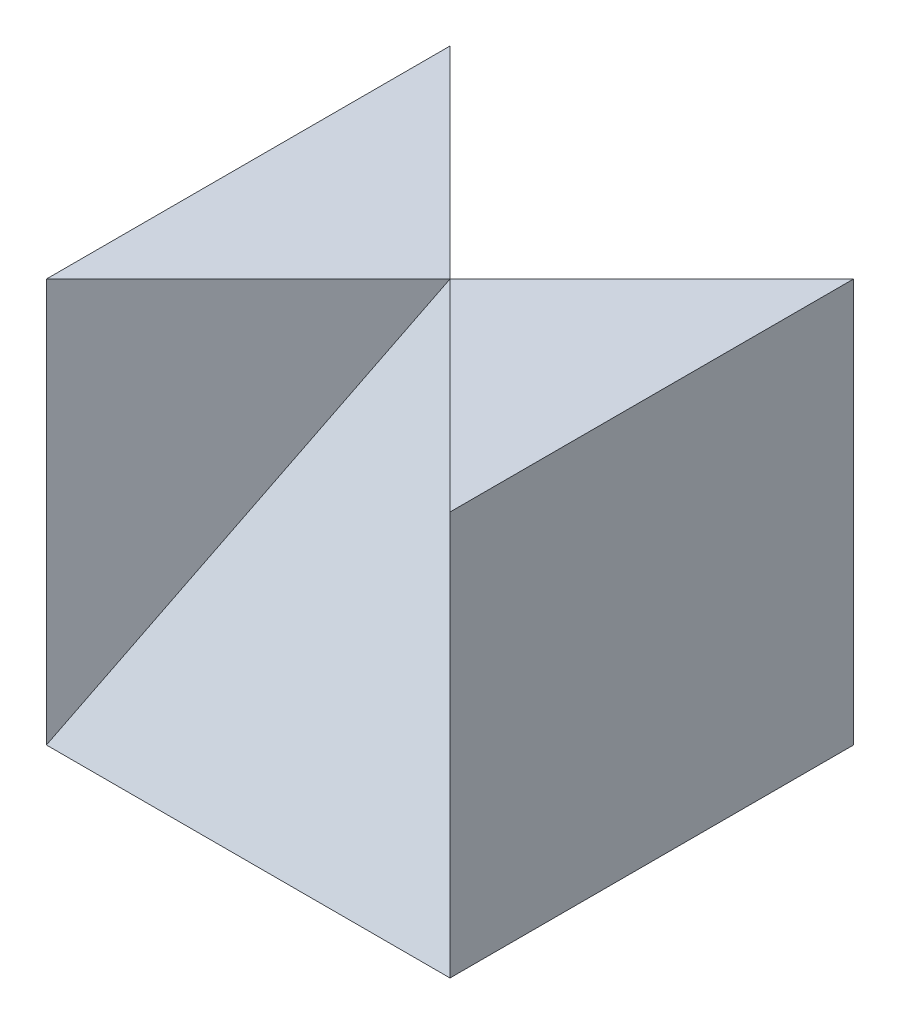
ISO-10303-21;
HEADER;
FILE_DESCRIPTION(('STEP AP214'),'2;1');
FILE_NAME('part.step','',(''),(''),'','','');
FILE_SCHEMA(('AUTOMOTIVE_DESIGN { 1 0 10303 214 1 1 1 1 }'));
ENDSEC;
DATA;
#1=APPLICATION_CONTEXT('core data for automotive mechanical design processes');
#2=APPLICATION_PROTOCOL_DEFINITION('international standard','automotive_design',2000,#1);
#3=PRODUCT_CONTEXT('',#1,'mechanical');
#4=PRODUCT('Part','Part','',(#3));
#5=PRODUCT_RELATED_PRODUCT_CATEGORY('part','',(#4));
#6=PRODUCT_DEFINITION_FORMATION('','',#4);
#7=PRODUCT_DEFINITION_CONTEXT('part definition',#1,'design');
#8=PRODUCT_DEFINITION('design','',#6,#7);
#9=PRODUCT_DEFINITION_SHAPE('','',#8);
#10=(LENGTH_UNIT() NAMED_UNIT(*) SI_UNIT(.MILLI.,.METRE.));
#11=(NAMED_UNIT(*) PLANE_ANGLE_UNIT() SI_UNIT($,.RADIAN.));
#12=(NAMED_UNIT(*) SI_UNIT($,.STERADIAN.) SOLID_ANGLE_UNIT());
#13=UNCERTAINTY_MEASURE_WITH_UNIT(LENGTH_MEASURE(1.E-05),#10,'distance_accuracy_value','');
#14=(GEOMETRIC_REPRESENTATION_CONTEXT(3) GLOBAL_UNCERTAINTY_ASSIGNED_CONTEXT((#13)) GLOBAL_UNIT_ASSIGNED_CONTEXT((#10,
#11,#12)) REPRESENTATION_CONTEXT('',''));
#15=CARTESIAN_POINT('',(0.,0.,0.));
#16=DIRECTION('',(0.,0.,1.));
#17=DIRECTION('',(1.,0.,0.));
#18=AXIS2_PLACEMENT_3D('',#15,#16,#17);
#19=CARTESIAN_POINT('',(0.,4.,0.));
#20=DIRECTION('',(0.,-1.,0.));
#21=DIRECTION('',(0.,0.,-1.));
#22=AXIS2_PLACEMENT_3D('',#19,#20,#21);
#23=PLANE('',#22);
#24=DIRECTION('',(0.707106781186548,0.,-0.707106781186548));
#25=VECTOR('',#24,1.);
#26=CARTESIAN_POINT('',(0.,4.,0.));
#27=LINE('',#26,#25);
#28=CARTESIAN_POINT('',(0.,4.,0.));
#29=VERTEX_POINT('',#28);
#30=CARTESIAN_POINT('',(2.,4.,-2.));
#31=VERTEX_POINT('',#30);
#32=EDGE_CURVE('E91',#29,#31,#27,.T.);
#33=ORIENTED_EDGE('',*,*,#32,.F.);
#34=DIRECTION('',(-0.707106781186548,0.,-0.707106781186548));
#35=VECTOR('',#34,1.);
#36=CARTESIAN_POINT('',(0.,4.,0.));
#37=LINE('',#36,#35);
#38=CARTESIAN_POINT('',(2.,4.,2.));
#39=VERTEX_POINT('',#38);
#40=EDGE_CURVE('E106',#39,#29,#37,.T.);
#41=ORIENTED_EDGE('',*,*,#40,.F.);
#42=DIRECTION('',(0.,0.,-1.));
#43=VECTOR('',#42,1.);
#44=CARTESIAN_POINT('',(2.,4.,2.));
#45=LINE('',#44,#43);
#46=EDGE_CURVE('E108',#39,#31,#45,.T.);
#47=ORIENTED_EDGE('',*,*,#46,.T.);
#48=EDGE_LOOP('',(#33,#41,#47));
#49=FACE_BOUND('',#48,.T.);
#50=ADVANCED_FACE('F35',(#49),#23,.F.);
#51=DIRECTION('',(-0.707106781186548,0.,0.707106781186548));
#52=VECTOR('',#51,1.);
#53=CARTESIAN_POINT('',(0.,4.,0.));
#54=LINE('',#53,#52);
#55=CARTESIAN_POINT('',(-2.,4.,2.));
#56=VERTEX_POINT('',#55);
#57=EDGE_CURVE('E117',#29,#56,#54,.T.);
#58=ORIENTED_EDGE('',*,*,#57,.F.);
#59=DIRECTION('',(-0.707106781186548,0.,-0.707106781186548));
#60=VECTOR('',#59,1.);
#61=CARTESIAN_POINT('',(0.,4.,0.));
#62=LINE('',#61,#60);
#63=CARTESIAN_POINT('',(-2.,4.,-2.));
#64=VERTEX_POINT('',#63);
#65=EDGE_CURVE('E80',#29,#64,#62,.T.);
#66=ORIENTED_EDGE('',*,*,#65,.T.);
#67=DIRECTION('',(0.,0.,1.));
#68=VECTOR('',#67,1.);
#69=CARTESIAN_POINT('',(-2.,4.,2.));
#70=LINE('',#69,#68);
#71=EDGE_CURVE('E129',#64,#56,#70,.T.);
#72=ORIENTED_EDGE('',*,*,#71,.T.);
#73=EDGE_LOOP('',(#58,#66,#72));
#74=FACE_BOUND('',#73,.T.);
#75=ADVANCED_FACE('F128',(#74),#23,.F.);
#76=CARTESIAN_POINT('',(2.,4.,2.));
#77=DIRECTION('',(-1.,0.,0.));
#78=DIRECTION('',(0.,0.,1.));
#79=AXIS2_PLACEMENT_3D('',#76,#77,#78);
#80=PLANE('',#79);
#81=DIRECTION('',(0.,0.,-1.));
#82=VECTOR('',#81,1.);
#83=CARTESIAN_POINT('',(2.,0.,2.));
#84=LINE('',#83,#82);
#85=CARTESIAN_POINT('',(2.,0.,2.));
#86=VERTEX_POINT('',#85);
#87=CARTESIAN_POINT('',(2.,0.,-2.));
#88=VERTEX_POINT('',#87);
#89=EDGE_CURVE('E116',#86,#88,#84,.T.);
#90=ORIENTED_EDGE('',*,*,#89,.T.);
#91=DIRECTION('',(0.,-1.,0.));
#92=VECTOR('',#91,1.);
#93=CARTESIAN_POINT('',(2.,4.,-2.));
#94=LINE('',#93,#92);
#95=EDGE_CURVE('E12',#31,#88,#94,.T.);
#96=ORIENTED_EDGE('',*,*,#95,.F.);
#97=ORIENTED_EDGE('',*,*,#46,.F.);
#98=DIRECTION('',(0.,-1.,0.));
#99=VECTOR('',#98,1.);
#100=CARTESIAN_POINT('',(2.,4.,2.));
#101=LINE('',#100,#99);
#102=EDGE_CURVE('E115',#39,#86,#101,.T.);
#103=ORIENTED_EDGE('',*,*,#102,.T.);
#104=EDGE_LOOP('',(#90,#96,#97,#103));
#105=FACE_BOUND('',#104,.T.);
#106=ADVANCED_FACE('F37',(#105),#80,.F.);
#107=CARTESIAN_POINT('',(-2.,4.,2.));
#108=DIRECTION('',(1.,0.,0.));
#109=DIRECTION('',(0.,0.,-1.));
#110=AXIS2_PLACEMENT_3D('',#107,#108,#109);
#111=PLANE('',#110);
#112=DIRECTION('',(0.,0.,1.));
#113=VECTOR('',#112,1.);
#114=CARTESIAN_POINT('',(-2.,0.,2.));
#115=LINE('',#114,#113);
#116=CARTESIAN_POINT('',(-2.,0.,-2.));
#117=VERTEX_POINT('',#116);
#118=CARTESIAN_POINT('',(-2.,0.,2.));
#119=VERTEX_POINT('',#118);
#120=EDGE_CURVE('E140',#117,#119,#115,.T.);
#121=ORIENTED_EDGE('',*,*,#120,.T.);
#122=DIRECTION('',(0.,-1.,0.));
#123=VECTOR('',#122,1.);
#124=CARTESIAN_POINT('',(-2.,4.,2.));
#125=LINE('',#124,#123);
#126=EDGE_CURVE('E52',#56,#119,#125,.T.);
#127=ORIENTED_EDGE('',*,*,#126,.F.);
#128=ORIENTED_EDGE('',*,*,#71,.F.);
#129=DIRECTION('',(0.,-1.,0.));
#130=VECTOR('',#129,1.);
#131=CARTESIAN_POINT('',(-2.,4.,-2.));
#132=LINE('',#131,#130);
#133=EDGE_CURVE('E44',#64,#117,#132,.T.);
#134=ORIENTED_EDGE('',*,*,#133,.T.);
#135=EDGE_LOOP('',(#121,#127,#128,#134));
#136=FACE_BOUND('',#135,.T.);
#137=ADVANCED_FACE('F163',(#136),#111,.F.);
#138=CARTESIAN_POINT('',(0.,0.,0.));
#139=DIRECTION('',(0.,-1.,0.));
#140=DIRECTION('',(0.,0.,-1.));
#141=AXIS2_PLACEMENT_3D('',#138,#139,#140);
#142=PLANE('',#141);
#143=ORIENTED_EDGE('',*,*,#89,.F.);
#144=DIRECTION('',(1.,0.,0.));
#145=VECTOR('',#144,1.);
#146=CARTESIAN_POINT('',(-2.,0.,2.));
#147=LINE('',#146,#145);
#148=EDGE_CURVE('E124',#119,#86,#147,.T.);
#149=ORIENTED_EDGE('',*,*,#148,.F.);
#150=ORIENTED_EDGE('',*,*,#120,.F.);
#151=DIRECTION('',(-1.,0.,0.));
#152=VECTOR('',#151,1.);
#153=CARTESIAN_POINT('',(-2.,0.,-2.));
#154=LINE('',#153,#152);
#155=EDGE_CURVE('E101',#88,#117,#154,.T.);
#156=ORIENTED_EDGE('',*,*,#155,.F.);
#157=EDGE_LOOP('',(#143,#149,#150,#156));
#158=FACE_BOUND('',#157,.T.);
#159=ADVANCED_FACE('F166',(#158),#142,.T.);
#160=CARTESIAN_POINT('',(0.,4.,0.));
#161=DIRECTION('',(-0.707106781186548,0.,0.707106781186548));
#162=DIRECTION('',(0.707106781186548,0.,0.707106781186548));
#163=AXIS2_PLACEMENT_3D('',#160,#161,#162);
#164=PLANE('',#163);
#165=ORIENTED_EDGE('',*,*,#40,.T.);
#166=DIRECTION('',(0.408248290463863,-0.816496580927726,0.408248290463863));
#167=VECTOR('',#166,1.);
#168=CARTESIAN_POINT('',(0.,4.,0.));
#169=LINE('',#168,#167);
#170=EDGE_CURVE('E90',#29,#86,#169,.T.);
#171=ORIENTED_EDGE('',*,*,#170,.T.);
#172=ORIENTED_EDGE('',*,*,#102,.F.);
#173=EDGE_LOOP('',(#165,#171,#172));
#174=FACE_BOUND('',#173,.T.);
#175=ADVANCED_FACE('F113',(#174),#164,.T.);
#176=CARTESIAN_POINT('',(-2.,0.,2.));
#177=DIRECTION('',(0.707106781186548,0.,0.707106781186548));
#178=DIRECTION('',(0.707106781186548,0.,-0.707106781186548));
#179=AXIS2_PLACEMENT_3D('',#176,#177,#178);
#180=PLANE('',#179);
#181=ORIENTED_EDGE('',*,*,#57,.T.);
#182=ORIENTED_EDGE('',*,*,#126,.T.);
#183=DIRECTION('',(0.408248290463863,0.816496580927726,-0.408248290463863));
#184=VECTOR('',#183,1.);
#185=CARTESIAN_POINT('',(-2.,0.,2.));
#186=LINE('',#185,#184);
#187=EDGE_CURVE('E121',#119,#29,#186,.T.);
#188=ORIENTED_EDGE('',*,*,#187,.T.);
#189=EDGE_LOOP('',(#181,#182,#188));
#190=FACE_BOUND('',#189,.T.);
#191=ADVANCED_FACE('F126',(#190),#180,.T.);
#192=CARTESIAN_POINT('',(0.,0.8,1.6));
#193=DIRECTION('',(0.,0.447213595499958,0.894427190999916));
#194=DIRECTION('',(0.,-0.894427190999916,0.447213595499958));
#195=AXIS2_PLACEMENT_3D('',#192,#193,#194);
#196=PLANE('',#195);
#197=ORIENTED_EDGE('',*,*,#148,.T.);
#198=ORIENTED_EDGE('',*,*,#170,.F.);
#199=ORIENTED_EDGE('',*,*,#187,.F.);
#200=EDGE_LOOP('',(#197,#198,#199));
#201=FACE_BOUND('',#200,.T.);
#202=ADVANCED_FACE('F120',(#201),#196,.T.);
#203=CARTESIAN_POINT('',(-2.,0.,-2.));
#204=DIRECTION('',(-0.707106781186548,0.,0.707106781186548));
#205=DIRECTION('',(0.707106781186548,0.,0.707106781186548));
#206=AXIS2_PLACEMENT_3D('',#203,#204,#205);
#207=PLANE('',#206);
#208=DIRECTION('',(0.408248290463863,0.816496580927726,0.408248290463863));
#209=VECTOR('',#208,1.);
#210=CARTESIAN_POINT('',(-2.,0.,-2.));
#211=LINE('',#210,#209);
#212=EDGE_CURVE('E83',#117,#29,#211,.T.);
#213=ORIENTED_EDGE('',*,*,#212,.F.);
#214=ORIENTED_EDGE('',*,*,#133,.F.);
#215=ORIENTED_EDGE('',*,*,#65,.F.);
#216=EDGE_LOOP('',(#213,#214,#215));
#217=FACE_BOUND('',#216,.T.);
#218=ADVANCED_FACE('F81',(#217),#207,.F.);
#219=CARTESIAN_POINT('',(2.,0.,-2.));
#220=DIRECTION('',(-0.707106781186548,0.,-0.707106781186548));
#221=DIRECTION('',(-0.707106781186548,0.,0.707106781186548));
#222=AXIS2_PLACEMENT_3D('',#219,#220,#221);
#223=PLANE('',#222);
#224=ORIENTED_EDGE('',*,*,#32,.T.);
#225=ORIENTED_EDGE('',*,*,#95,.T.);
#226=DIRECTION('',(-0.408248290463863,0.816496580927726,0.408248290463863));
#227=VECTOR('',#226,1.);
#228=CARTESIAN_POINT('',(2.,0.,-2.));
#229=LINE('',#228,#227);
#230=EDGE_CURVE('E93',#88,#29,#229,.T.);
#231=ORIENTED_EDGE('',*,*,#230,.T.);
#232=EDGE_LOOP('',(#224,#225,#231));
#233=FACE_BOUND('',#232,.T.);
#234=ADVANCED_FACE('F94',(#233),#223,.T.);
#235=CARTESIAN_POINT('',(0.,0.8,-1.6));
#236=DIRECTION('',(0.,-0.447213595499958,0.894427190999916));
#237=DIRECTION('',(0.,-0.894427190999916,-0.447213595499958));
#238=AXIS2_PLACEMENT_3D('',#235,#236,#237);
#239=PLANE('',#238);
#240=ORIENTED_EDGE('',*,*,#212,.T.);
#241=ORIENTED_EDGE('',*,*,#230,.F.);
#242=ORIENTED_EDGE('',*,*,#155,.T.);
#243=EDGE_LOOP('',(#240,#241,#242));
#244=FACE_BOUND('',#243,.T.);
#245=ADVANCED_FACE('F100',(#244),#239,.F.);
#246=CLOSED_SHELL('',(#50,#75,#106,#137,#159,#175,#191,#202,#218,#234,#245));
#247=MANIFOLD_SOLID_BREP('B2',#246);
#248=ADVANCED_BREP_SHAPE_REPRESENTATION('',(#18,#247),#14);
#249=SHAPE_DEFINITION_REPRESENTATION(#9,#248);
ENDSEC;
END-ISO-10303-21;
